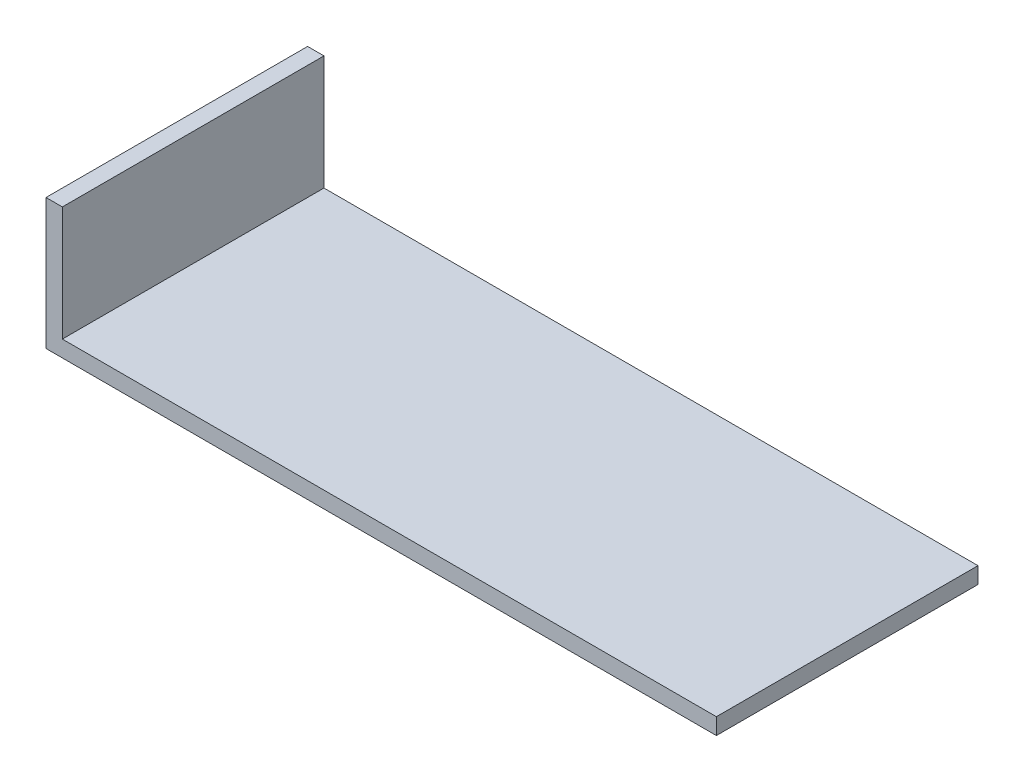
ISO-10303-21;
HEADER;
FILE_DESCRIPTION(('STEP AP214'),'2;1');
FILE_NAME('part.step','',(''),(''),'','','');
FILE_SCHEMA(('AUTOMOTIVE_DESIGN { 1 0 10303 214 1 1 1 1 }'));
ENDSEC;
DATA;
#1=APPLICATION_CONTEXT('core data for automotive mechanical design processes');
#2=APPLICATION_PROTOCOL_DEFINITION('international standard','automotive_design',2000,#1);
#3=PRODUCT_CONTEXT('',#1,'mechanical');
#4=PRODUCT('Part','Part','',(#3));
#5=PRODUCT_RELATED_PRODUCT_CATEGORY('part','',(#4));
#6=PRODUCT_DEFINITION_FORMATION('','',#4);
#7=PRODUCT_DEFINITION_CONTEXT('part definition',#1,'design');
#8=PRODUCT_DEFINITION('design','',#6,#7);
#9=PRODUCT_DEFINITION_SHAPE('','',#8);
#10=(LENGTH_UNIT() NAMED_UNIT(*) SI_UNIT(.MILLI.,.METRE.));
#11=(NAMED_UNIT(*) PLANE_ANGLE_UNIT() SI_UNIT($,.RADIAN.));
#12=(NAMED_UNIT(*) SI_UNIT($,.STERADIAN.) SOLID_ANGLE_UNIT());
#13=UNCERTAINTY_MEASURE_WITH_UNIT(LENGTH_MEASURE(1.E-05),#10,'distance_accuracy_value','');
#14=(GEOMETRIC_REPRESENTATION_CONTEXT(3) GLOBAL_UNCERTAINTY_ASSIGNED_CONTEXT((#13)) GLOBAL_UNIT_ASSIGNED_CONTEXT((#10,
#11,#12)) REPRESENTATION_CONTEXT('',''));
#15=CARTESIAN_POINT('',(0.,0.,0.));
#16=DIRECTION('',(0.,0.,1.));
#17=DIRECTION('',(1.,0.,0.));
#18=AXIS2_PLACEMENT_3D('',#15,#16,#17);
#19=CARTESIAN_POINT('',(0.,25.4,50.8));
#20=DIRECTION('',(1.,0.,0.));
#21=DIRECTION('',(0.,1.,0.));
#22=AXIS2_PLACEMENT_3D('',#19,#20,#21);
#23=PLANE('',#22);
#24=DIRECTION('',(0.,-1.,0.));
#25=VECTOR('',#24,1.);
#26=CARTESIAN_POINT('',(0.,25.4,0.));
#27=LINE('',#26,#25);
#28=CARTESIAN_POINT('',(0.,25.4,0.));
#29=VERTEX_POINT('',#28);
#30=CARTESIAN_POINT('',(0.,0.,0.));
#31=VERTEX_POINT('',#30);
#32=EDGE_CURVE('E117',#29,#31,#27,.T.);
#33=ORIENTED_EDGE('',*,*,#32,.T.);
#34=DIRECTION('',(0.,0.,-1.));
#35=VECTOR('',#34,1.);
#36=CARTESIAN_POINT('',(0.,0.,50.8));
#37=LINE('',#36,#35);
#38=CARTESIAN_POINT('',(0.,0.,50.8));
#39=VERTEX_POINT('',#38);
#40=EDGE_CURVE('E11',#39,#31,#37,.T.);
#41=ORIENTED_EDGE('',*,*,#40,.F.);
#42=DIRECTION('',(0.,-1.,0.));
#43=VECTOR('',#42,1.);
#44=CARTESIAN_POINT('',(0.,25.4,50.8));
#45=LINE('',#44,#43);
#46=CARTESIAN_POINT('',(0.,25.4,50.8));
#47=VERTEX_POINT('',#46);
#48=EDGE_CURVE('E127',#47,#39,#45,.T.);
#49=ORIENTED_EDGE('',*,*,#48,.F.);
#50=DIRECTION('',(0.,0.,-1.));
#51=VECTOR('',#50,1.);
#52=CARTESIAN_POINT('',(0.,25.4,50.8));
#53=LINE('',#52,#51);
#54=EDGE_CURVE('E113',#47,#29,#53,.T.);
#55=ORIENTED_EDGE('',*,*,#54,.T.);
#56=EDGE_LOOP('',(#33,#41,#49,#55));
#57=FACE_BOUND('',#56,.T.);
#58=ADVANCED_FACE('F33',(#57),#23,.F.);
#59=CARTESIAN_POINT('',(0.,0.,50.8));
#60=DIRECTION('',(0.,1.,0.));
#61=DIRECTION('',(0.,0.,1.));
#62=AXIS2_PLACEMENT_3D('',#59,#60,#61);
#63=PLANE('',#62);
#64=DIRECTION('',(1.,0.,0.));
#65=VECTOR('',#64,1.);
#66=CARTESIAN_POINT('',(0.,0.,0.));
#67=LINE('',#66,#65);
#68=CARTESIAN_POINT('',(130.175,0.,0.));
#69=VERTEX_POINT('',#68);
#70=EDGE_CURVE('E120',#31,#69,#67,.T.);
#71=ORIENTED_EDGE('',*,*,#70,.T.);
#72=DIRECTION('',(0.,0.,-1.));
#73=VECTOR('',#72,1.);
#74=CARTESIAN_POINT('',(130.175,0.,50.8));
#75=LINE('',#74,#73);
#76=CARTESIAN_POINT('',(130.175,0.,50.8));
#77=VERTEX_POINT('',#76);
#78=EDGE_CURVE('E41',#77,#69,#75,.T.);
#79=ORIENTED_EDGE('',*,*,#78,.F.);
#80=DIRECTION('',(1.,0.,0.));
#81=VECTOR('',#80,1.);
#82=CARTESIAN_POINT('',(0.,0.,50.8));
#83=LINE('',#82,#81);
#84=EDGE_CURVE('E86',#39,#77,#83,.T.);
#85=ORIENTED_EDGE('',*,*,#84,.F.);
#86=ORIENTED_EDGE('',*,*,#40,.T.);
#87=EDGE_LOOP('',(#71,#79,#85,#86));
#88=FACE_BOUND('',#87,.T.);
#89=ADVANCED_FACE('F151',(#88),#63,.F.);
#90=CARTESIAN_POINT('',(130.175,0.,50.8));
#91=DIRECTION('',(-1.,0.,0.));
#92=DIRECTION('',(0.,0.,1.));
#93=AXIS2_PLACEMENT_3D('',#90,#91,#92);
#94=PLANE('',#93);
#95=DIRECTION('',(0.,1.,0.));
#96=VECTOR('',#95,1.);
#97=CARTESIAN_POINT('',(130.175,0.,0.));
#98=LINE('',#97,#96);
#99=CARTESIAN_POINT('',(130.175,3.175,0.));
#100=VERTEX_POINT('',#99);
#101=EDGE_CURVE('E122',#69,#100,#98,.T.);
#102=ORIENTED_EDGE('',*,*,#101,.T.);
#103=DIRECTION('',(0.,0.,-1.));
#104=VECTOR('',#103,1.);
#105=CARTESIAN_POINT('',(130.175,3.175,50.8));
#106=LINE('',#105,#104);
#107=CARTESIAN_POINT('',(130.175,3.175,50.8));
#108=VERTEX_POINT('',#107);
#109=EDGE_CURVE('E108',#108,#100,#106,.T.);
#110=ORIENTED_EDGE('',*,*,#109,.F.);
#111=DIRECTION('',(0.,1.,0.));
#112=VECTOR('',#111,1.);
#113=CARTESIAN_POINT('',(130.175,0.,50.8));
#114=LINE('',#113,#112);
#115=EDGE_CURVE('E99',#77,#108,#114,.T.);
#116=ORIENTED_EDGE('',*,*,#115,.F.);
#117=ORIENTED_EDGE('',*,*,#78,.T.);
#118=EDGE_LOOP('',(#102,#110,#116,#117));
#119=FACE_BOUND('',#118,.T.);
#120=ADVANCED_FACE('F133',(#119),#94,.F.);
#121=CARTESIAN_POINT('',(130.175,3.175,50.8));
#122=DIRECTION('',(0.,-1.,0.));
#123=DIRECTION('',(1.,0.,0.));
#124=AXIS2_PLACEMENT_3D('',#121,#122,#123);
#125=PLANE('',#124);
#126=DIRECTION('',(-1.,0.,0.));
#127=VECTOR('',#126,1.);
#128=CARTESIAN_POINT('',(130.175,3.175,0.));
#129=LINE('',#128,#127);
#130=CARTESIAN_POINT('',(3.175,3.17499999999999,0.));
#131=VERTEX_POINT('',#130);
#132=EDGE_CURVE('E107',#100,#131,#129,.T.);
#133=ORIENTED_EDGE('',*,*,#132,.T.);
#134=DIRECTION('',(0.,0.,-1.));
#135=VECTOR('',#134,1.);
#136=CARTESIAN_POINT('',(3.175,3.17499999999999,50.8));
#137=LINE('',#136,#135);
#138=CARTESIAN_POINT('',(3.175,3.17499999999999,50.8));
#139=VERTEX_POINT('',#138);
#140=EDGE_CURVE('E104',#139,#131,#137,.T.);
#141=ORIENTED_EDGE('',*,*,#140,.F.);
#142=DIRECTION('',(-1.,0.,0.));
#143=VECTOR('',#142,1.);
#144=CARTESIAN_POINT('',(130.175,3.175,50.8));
#145=LINE('',#144,#143);
#146=EDGE_CURVE('E93',#108,#139,#145,.T.);
#147=ORIENTED_EDGE('',*,*,#146,.F.);
#148=ORIENTED_EDGE('',*,*,#109,.T.);
#149=EDGE_LOOP('',(#133,#141,#147,#148));
#150=FACE_BOUND('',#149,.T.);
#151=ADVANCED_FACE('F105',(#150),#125,.F.);
#152=CARTESIAN_POINT('',(3.175,3.17499999999999,50.8));
#153=DIRECTION('',(-1.,0.,0.));
#154=DIRECTION('',(0.,-1.,0.));
#155=AXIS2_PLACEMENT_3D('',#152,#153,#154);
#156=PLANE('',#155);
#157=DIRECTION('',(0.,1.,0.));
#158=VECTOR('',#157,1.);
#159=CARTESIAN_POINT('',(3.175,3.17499999999999,0.));
#160=LINE('',#159,#158);
#161=CARTESIAN_POINT('',(3.175,25.4,0.));
#162=VERTEX_POINT('',#161);
#163=EDGE_CURVE('E72',#131,#162,#160,.T.);
#164=ORIENTED_EDGE('',*,*,#163,.T.);
#165=DIRECTION('',(0.,0.,-1.));
#166=VECTOR('',#165,1.);
#167=CARTESIAN_POINT('',(3.175,25.4,50.8));
#168=LINE('',#167,#166);
#169=CARTESIAN_POINT('',(3.175,25.4,50.8));
#170=VERTEX_POINT('',#169);
#171=EDGE_CURVE('E109',#170,#162,#168,.T.);
#172=ORIENTED_EDGE('',*,*,#171,.F.);
#173=DIRECTION('',(0.,1.,0.));
#174=VECTOR('',#173,1.);
#175=CARTESIAN_POINT('',(3.175,3.17499999999999,50.8));
#176=LINE('',#175,#174);
#177=EDGE_CURVE('E97',#139,#170,#176,.T.);
#178=ORIENTED_EDGE('',*,*,#177,.F.);
#179=ORIENTED_EDGE('',*,*,#140,.T.);
#180=EDGE_LOOP('',(#164,#172,#178,#179));
#181=FACE_BOUND('',#180,.T.);
#182=ADVANCED_FACE('F111',(#181),#156,.F.);
#183=CARTESIAN_POINT('',(3.175,25.4,50.8));
#184=DIRECTION('',(0.,-1.,0.));
#185=DIRECTION('',(0.,0.,-1.));
#186=AXIS2_PLACEMENT_3D('',#183,#184,#185);
#187=PLANE('',#186);
#188=DIRECTION('',(-1.,0.,0.));
#189=VECTOR('',#188,1.);
#190=CARTESIAN_POINT('',(3.175,25.4,0.));
#191=LINE('',#190,#189);
#192=EDGE_CURVE('E78',#162,#29,#191,.T.);
#193=ORIENTED_EDGE('',*,*,#192,.T.);
#194=ORIENTED_EDGE('',*,*,#54,.F.);
#195=DIRECTION('',(-1.,0.,0.));
#196=VECTOR('',#195,1.);
#197=CARTESIAN_POINT('',(3.175,25.4,50.8));
#198=LINE('',#197,#196);
#199=EDGE_CURVE('E49',#170,#47,#198,.T.);
#200=ORIENTED_EDGE('',*,*,#199,.F.);
#201=ORIENTED_EDGE('',*,*,#171,.T.);
#202=EDGE_LOOP('',(#193,#194,#200,#201));
#203=FACE_BOUND('',#202,.T.);
#204=ADVANCED_FACE('F140',(#203),#187,.F.);
#205=CARTESIAN_POINT('',(0.,0.,50.8));
#206=DIRECTION('',(0.,0.,1.));
#207=DIRECTION('',(1.,0.,0.));
#208=AXIS2_PLACEMENT_3D('',#205,#206,#207);
#209=PLANE('',#208);
#210=ORIENTED_EDGE('',*,*,#48,.T.);
#211=ORIENTED_EDGE('',*,*,#84,.T.);
#212=ORIENTED_EDGE('',*,*,#115,.T.);
#213=ORIENTED_EDGE('',*,*,#146,.T.);
#214=ORIENTED_EDGE('',*,*,#177,.T.);
#215=ORIENTED_EDGE('',*,*,#199,.T.);
#216=EDGE_LOOP('',(#210,#211,#212,#213,#214,#215));
#217=FACE_BOUND('',#216,.T.);
#218=ADVANCED_FACE('F95',(#217),#209,.T.);
#219=CARTESIAN_POINT('',(0.,0.,0.));
#220=DIRECTION('',(0.,0.,1.));
#221=DIRECTION('',(1.,0.,0.));
#222=AXIS2_PLACEMENT_3D('',#219,#220,#221);
#223=PLANE('',#222);
#224=ORIENTED_EDGE('',*,*,#32,.F.);
#225=ORIENTED_EDGE('',*,*,#192,.F.);
#226=ORIENTED_EDGE('',*,*,#163,.F.);
#227=ORIENTED_EDGE('',*,*,#132,.F.);
#228=ORIENTED_EDGE('',*,*,#101,.F.);
#229=ORIENTED_EDGE('',*,*,#70,.F.);
#230=EDGE_LOOP('',(#224,#225,#226,#227,#228,#229));
#231=FACE_BOUND('',#230,.T.);
#232=ADVANCED_FACE('F136',(#231),#223,.F.);
#233=CLOSED_SHELL('',(#58,#89,#120,#151,#182,#204,#218,#232));
#234=MANIFOLD_SOLID_BREP('B2',#233);
#235=ADVANCED_BREP_SHAPE_REPRESENTATION('',(#18,#234),#14);
#236=SHAPE_DEFINITION_REPRESENTATION(#9,#235);
ENDSEC;
END-ISO-10303-21;
